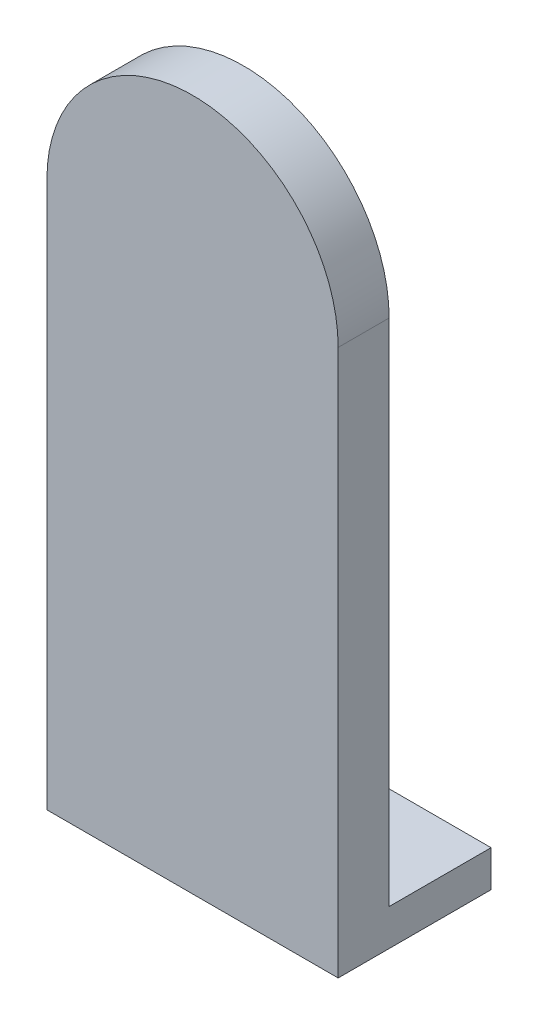
ISO-10303-21;
HEADER;
FILE_DESCRIPTION(('STEP AP214'),'2;1');
FILE_NAME('part.step','',(''),(''),'','','');
FILE_SCHEMA(('AUTOMOTIVE_DESIGN { 1 0 10303 214 1 1 1 1 }'));
ENDSEC;
DATA;
#1=APPLICATION_CONTEXT('core data for automotive mechanical design processes');
#2=APPLICATION_PROTOCOL_DEFINITION('international standard','automotive_design',2000,#1);
#3=PRODUCT_CONTEXT('',#1,'mechanical');
#4=PRODUCT('Part','Part','',(#3));
#5=PRODUCT_RELATED_PRODUCT_CATEGORY('part','',(#4));
#6=PRODUCT_DEFINITION_FORMATION('','',#4);
#7=PRODUCT_DEFINITION_CONTEXT('part definition',#1,'design');
#8=PRODUCT_DEFINITION('design','',#6,#7);
#9=PRODUCT_DEFINITION_SHAPE('','',#8);
#10=(LENGTH_UNIT() NAMED_UNIT(*) SI_UNIT(.MILLI.,.METRE.));
#11=(NAMED_UNIT(*) PLANE_ANGLE_UNIT() SI_UNIT($,.RADIAN.));
#12=(NAMED_UNIT(*) SI_UNIT($,.STERADIAN.) SOLID_ANGLE_UNIT());
#13=UNCERTAINTY_MEASURE_WITH_UNIT(LENGTH_MEASURE(1.E-05),#10,'distance_accuracy_value','');
#14=(GEOMETRIC_REPRESENTATION_CONTEXT(3) GLOBAL_UNCERTAINTY_ASSIGNED_CONTEXT((#13)) GLOBAL_UNIT_ASSIGNED_CONTEXT((#10,
#11,#12)) REPRESENTATION_CONTEXT('',''));
#15=CARTESIAN_POINT('',(0.,0.,0.));
#16=DIRECTION('',(0.,0.,1.));
#17=DIRECTION('',(1.,0.,0.));
#18=AXIS2_PLACEMENT_3D('',#15,#16,#17);
#19=CARTESIAN_POINT('',(0.,0.,0.));
#20=DIRECTION('',(0.,0.,1.));
#21=DIRECTION('',(1.,0.,0.));
#22=AXIS2_PLACEMENT_3D('',#19,#20,#21);
#23=PLANE('',#22);
#24=CARTESIAN_POINT('',(0.,0.,0.));
#25=DIRECTION('',(0.,0.,1.));
#26=DIRECTION('',(1.,0.,0.));
#27=AXIS2_PLACEMENT_3D('',#24,#25,#26);
#28=CIRCLE('',#27,5.);
#29=CARTESIAN_POINT('',(5.,0.,0.));
#30=VERTEX_POINT('',#29);
#31=EDGE_CURVE('E11',#30,#30,#28,.F.);
#32=ORIENTED_EDGE('',*,*,#31,.F.);
#33=EDGE_LOOP('',(#32));
#34=FACE_BOUND('',#33,.T.);
#35=DIRECTION('',(1.,0.,0.));
#36=VECTOR('',#35,1.);
#37=CARTESIAN_POINT('',(20.,-70.,0.));
#38=LINE('',#37,#36);
#39=CARTESIAN_POINT('',(-20.,-70.,0.));
#40=VERTEX_POINT('',#39);
#41=CARTESIAN_POINT('',(20.,-70.,0.));
#42=VERTEX_POINT('',#41);
#43=EDGE_CURVE('E52',#40,#42,#38,.T.);
#44=ORIENTED_EDGE('',*,*,#43,.F.);
#45=DIRECTION('',(0.,-1.,0.));
#46=VECTOR('',#45,1.);
#47=CARTESIAN_POINT('',(-20.,0.,0.));
#48=LINE('',#47,#46);
#49=CARTESIAN_POINT('',(-20.,0.,0.));
#50=VERTEX_POINT('',#49);
#51=EDGE_CURVE('E145',#50,#40,#48,.T.);
#52=ORIENTED_EDGE('',*,*,#51,.F.);
#53=CARTESIAN_POINT('',(0.,0.,0.));
#54=DIRECTION('',(0.,0.,1.));
#55=DIRECTION('',(1.,0.,0.));
#56=AXIS2_PLACEMENT_3D('',#53,#54,#55);
#57=CIRCLE('',#56,20.);
#58=CARTESIAN_POINT('',(20.,0.,0.));
#59=VERTEX_POINT('',#58);
#60=EDGE_CURVE('E136',#59,#50,#57,.T.);
#61=ORIENTED_EDGE('',*,*,#60,.F.);
#62=DIRECTION('',(0.,1.,0.));
#63=VECTOR('',#62,1.);
#64=CARTESIAN_POINT('',(20.,0.,0.));
#65=LINE('',#64,#63);
#66=EDGE_CURVE('E74',#42,#59,#65,.T.);
#67=ORIENTED_EDGE('',*,*,#66,.F.);
#68=EDGE_LOOP('',(#44,#52,#61,#67));
#69=FACE_BOUND('',#68,.T.);
#70=ADVANCED_FACE('F37',(#34,#69),#23,.F.);
#71=CARTESIAN_POINT('',(0.,0.,7.));
#72=DIRECTION('',(0.,0.,-1.));
#73=DIRECTION('',(-1.,0.,0.));
#74=AXIS2_PLACEMENT_3D('',#71,#72,#73);
#75=CYLINDRICAL_SURFACE('',#74,20.);
#76=ORIENTED_EDGE('',*,*,#60,.T.);
#77=DIRECTION('',(0.,0.,-1.));
#78=VECTOR('',#77,1.);
#79=CARTESIAN_POINT('',(-20.,0.,7.));
#80=LINE('',#79,#78);
#81=CARTESIAN_POINT('',(-20.,0.,7.));
#82=VERTEX_POINT('',#81);
#83=EDGE_CURVE('E45',#82,#50,#80,.T.);
#84=ORIENTED_EDGE('',*,*,#83,.F.);
#85=CARTESIAN_POINT('',(0.,0.,7.));
#86=DIRECTION('',(0.,0.,1.));
#87=DIRECTION('',(1.,0.,0.));
#88=AXIS2_PLACEMENT_3D('',#85,#86,#87);
#89=CIRCLE('',#88,20.);
#90=CARTESIAN_POINT('',(20.,0.,7.));
#91=VERTEX_POINT('',#90);
#92=EDGE_CURVE('E137',#91,#82,#89,.T.);
#93=ORIENTED_EDGE('',*,*,#92,.F.);
#94=DIRECTION('',(0.,0.,-1.));
#95=VECTOR('',#94,1.);
#96=CARTESIAN_POINT('',(20.,0.,7.));
#97=LINE('',#96,#95);
#98=EDGE_CURVE('E106',#91,#59,#97,.T.);
#99=ORIENTED_EDGE('',*,*,#98,.T.);
#100=EDGE_LOOP('',(#76,#84,#93,#99));
#101=FACE_BOUND('',#100,.T.);
#102=ADVANCED_FACE('F39',(#101),#75,.T.);
#103=CARTESIAN_POINT('',(-20.,0.,7.));
#104=DIRECTION('',(1.,0.,0.));
#105=DIRECTION('',(0.,1.,0.));
#106=AXIS2_PLACEMENT_3D('',#103,#104,#105);
#107=PLANE('',#106);
#108=ORIENTED_EDGE('',*,*,#51,.T.);
#109=DIRECTION('',(0.,0.,1.));
#110=VECTOR('',#109,1.);
#111=CARTESIAN_POINT('',(-20.,-70.,-14.));
#112=LINE('',#111,#110);
#113=CARTESIAN_POINT('',(-20.,-70.,-14.));
#114=VERTEX_POINT('',#113);
#115=EDGE_CURVE('E130',#114,#40,#112,.T.);
#116=ORIENTED_EDGE('',*,*,#115,.F.);
#117=DIRECTION('',(0.,1.,0.));
#118=VECTOR('',#117,1.);
#119=CARTESIAN_POINT('',(-20.,-70.,-14.));
#120=LINE('',#119,#118);
#121=CARTESIAN_POINT('',(-20.,-75.,-14.));
#122=VERTEX_POINT('',#121);
#123=EDGE_CURVE('E113',#122,#114,#120,.T.);
#124=ORIENTED_EDGE('',*,*,#123,.F.);
#125=DIRECTION('',(0.,0.,-1.));
#126=VECTOR('',#125,1.);
#127=CARTESIAN_POINT('',(-20.,-75.,7.));
#128=LINE('',#127,#126);
#129=CARTESIAN_POINT('',(-20.,-75.,7.));
#130=VERTEX_POINT('',#129);
#131=EDGE_CURVE('E105',#130,#122,#128,.T.);
#132=ORIENTED_EDGE('',*,*,#131,.F.);
#133=DIRECTION('',(0.,-1.,0.));
#134=VECTOR('',#133,1.);
#135=CARTESIAN_POINT('',(-20.,0.,7.));
#136=LINE('',#135,#134);
#137=EDGE_CURVE('E82',#82,#130,#136,.T.);
#138=ORIENTED_EDGE('',*,*,#137,.F.);
#139=ORIENTED_EDGE('',*,*,#83,.T.);
#140=EDGE_LOOP('',(#108,#116,#124,#132,#138,#139));
#141=FACE_BOUND('',#140,.T.);
#142=ADVANCED_FACE('F151',(#141),#107,.F.);
#143=CARTESIAN_POINT('',(-20.,-75.,7.));
#144=DIRECTION('',(0.,1.,0.));
#145=DIRECTION('',(0.,0.,1.));
#146=AXIS2_PLACEMENT_3D('',#143,#144,#145);
#147=PLANE('',#146);
#148=CARTESIAN_POINT('',(-10.,-75.,-7.));
#149=DIRECTION('',(0.,1.,0.));
#150=DIRECTION('',(0.,0.,1.));
#151=AXIS2_PLACEMENT_3D('',#148,#149,#150);
#152=CIRCLE('',#151,1.5);
#153=CARTESIAN_POINT('',(-10.,-75.,-5.5));
#154=VERTEX_POINT('',#153);
#155=EDGE_CURVE('E282',#154,#154,#152,.T.);
#156=ORIENTED_EDGE('',*,*,#155,.T.);
#157=EDGE_LOOP('',(#156));
#158=FACE_BOUND('',#157,.T.);
#159=CARTESIAN_POINT('',(10.,-75.,-7.));
#160=DIRECTION('',(0.,1.,0.));
#161=DIRECTION('',(0.,0.,1.));
#162=AXIS2_PLACEMENT_3D('',#159,#160,#161);
#163=CIRCLE('',#162,1.5);
#164=CARTESIAN_POINT('',(10.,-75.,-5.5));
#165=VERTEX_POINT('',#164);
#166=EDGE_CURVE('E120',#165,#165,#163,.T.);
#167=ORIENTED_EDGE('',*,*,#166,.T.);
#168=EDGE_LOOP('',(#167));
#169=FACE_BOUND('',#168,.T.);
#170=ORIENTED_EDGE('',*,*,#131,.T.);
#171=DIRECTION('',(-1.,0.,0.));
#172=VECTOR('',#171,1.);
#173=CARTESIAN_POINT('',(20.,-75.,-14.));
#174=LINE('',#173,#172);
#175=CARTESIAN_POINT('',(20.,-75.,-14.));
#176=VERTEX_POINT('',#175);
#177=EDGE_CURVE('E109',#176,#122,#174,.T.);
#178=ORIENTED_EDGE('',*,*,#177,.F.);
#179=DIRECTION('',(0.,0.,-1.));
#180=VECTOR('',#179,1.);
#181=CARTESIAN_POINT('',(20.,-75.,7.));
#182=LINE('',#181,#180);
#183=CARTESIAN_POINT('',(20.,-75.,7.));
#184=VERTEX_POINT('',#183);
#185=EDGE_CURVE('E98',#184,#176,#182,.T.);
#186=ORIENTED_EDGE('',*,*,#185,.F.);
#187=DIRECTION('',(1.,0.,0.));
#188=VECTOR('',#187,1.);
#189=CARTESIAN_POINT('',(-20.,-75.,7.));
#190=LINE('',#189,#188);
#191=EDGE_CURVE('E140',#130,#184,#190,.T.);
#192=ORIENTED_EDGE('',*,*,#191,.F.);
#193=EDGE_LOOP('',(#170,#178,#186,#192));
#194=FACE_BOUND('',#193,.T.);
#195=ADVANCED_FACE('F110',(#158,#169,#194),#147,.F.);
#196=CARTESIAN_POINT('',(20.,0.,7.));
#197=DIRECTION('',(-1.,0.,0.));
#198=DIRECTION('',(0.,-1.,0.));
#199=AXIS2_PLACEMENT_3D('',#196,#197,#198);
#200=PLANE('',#199);
#201=ORIENTED_EDGE('',*,*,#185,.T.);
#202=DIRECTION('',(0.,-1.,0.));
#203=VECTOR('',#202,1.);
#204=CARTESIAN_POINT('',(20.,-70.,-14.));
#205=LINE('',#204,#203);
#206=CARTESIAN_POINT('',(20.,-70.,-14.));
#207=VERTEX_POINT('',#206);
#208=EDGE_CURVE('E102',#207,#176,#205,.T.);
#209=ORIENTED_EDGE('',*,*,#208,.F.);
#210=DIRECTION('',(0.,0.,1.));
#211=VECTOR('',#210,1.);
#212=CARTESIAN_POINT('',(20.,-70.,-14.));
#213=LINE('',#212,#211);
#214=EDGE_CURVE('E127',#207,#42,#213,.T.);
#215=ORIENTED_EDGE('',*,*,#214,.T.);
#216=ORIENTED_EDGE('',*,*,#66,.T.);
#217=ORIENTED_EDGE('',*,*,#98,.F.);
#218=DIRECTION('',(0.,1.,0.));
#219=VECTOR('',#218,1.);
#220=CARTESIAN_POINT('',(20.,0.,7.));
#221=LINE('',#220,#219);
#222=EDGE_CURVE('E61',#184,#91,#221,.T.);
#223=ORIENTED_EDGE('',*,*,#222,.F.);
#224=EDGE_LOOP('',(#201,#209,#215,#216,#217,#223));
#225=FACE_BOUND('',#224,.T.);
#226=ADVANCED_FACE('F100',(#225),#200,.F.);
#227=CARTESIAN_POINT('',(0.,0.,7.));
#228=DIRECTION('',(0.,0.,1.));
#229=DIRECTION('',(1.,0.,0.));
#230=AXIS2_PLACEMENT_3D('',#227,#228,#229);
#231=PLANE('',#230);
#232=ORIENTED_EDGE('',*,*,#92,.T.);
#233=ORIENTED_EDGE('',*,*,#137,.T.);
#234=ORIENTED_EDGE('',*,*,#191,.T.);
#235=ORIENTED_EDGE('',*,*,#222,.T.);
#236=EDGE_LOOP('',(#232,#233,#234,#235));
#237=FACE_BOUND('',#236,.T.);
#238=ADVANCED_FACE('F158',(#237),#231,.T.);
#239=CARTESIAN_POINT('',(0.,0.,-4.));
#240=DIRECTION('',(0.,0.,1.));
#241=DIRECTION('',(1.,0.,0.));
#242=AXIS2_PLACEMENT_3D('',#239,#240,#241);
#243=CYLINDRICAL_SURFACE('',#242,5.);
#244=CARTESIAN_POINT('',(0.,0.,-4.));
#245=DIRECTION('',(0.,0.,-1.));
#246=DIRECTION('',(-1.,0.,0.));
#247=AXIS2_PLACEMENT_3D('',#244,#245,#246);
#248=CIRCLE('',#247,5.);
#249=CARTESIAN_POINT('',(-5.,0.,-4.));
#250=VERTEX_POINT('',#249);
#251=EDGE_CURVE('E133',#250,#250,#248,.T.);
#252=ORIENTED_EDGE('',*,*,#251,.F.);
#253=EDGE_LOOP('',(#252));
#254=FACE_BOUND('',#253,.T.);
#255=ORIENTED_EDGE('',*,*,#31,.T.);
#256=EDGE_LOOP('',(#255));
#257=FACE_BOUND('',#256,.T.);
#258=ADVANCED_FACE('F160',(#254,#257),#243,.T.);
#259=CARTESIAN_POINT('',(0.,0.,-4.));
#260=DIRECTION('',(0.,0.,-1.));
#261=DIRECTION('',(-1.,0.,0.));
#262=AXIS2_PLACEMENT_3D('',#259,#260,#261);
#263=PLANE('',#262);
#264=ORIENTED_EDGE('',*,*,#251,.T.);
#265=EDGE_LOOP('',(#264));
#266=FACE_BOUND('',#265,.T.);
#267=ADVANCED_FACE('F166',(#266),#263,.T.);
#268=CARTESIAN_POINT('',(20.,-70.,-14.));
#269=DIRECTION('',(0.,-1.,0.));
#270=DIRECTION('',(0.,0.,-1.));
#271=AXIS2_PLACEMENT_3D('',#268,#269,#270);
#272=PLANE('',#271);
#273=CARTESIAN_POINT('',(-10.,-70.,-7.));
#274=DIRECTION('',(0.,1.,0.));
#275=DIRECTION('',(0.,0.,1.));
#276=AXIS2_PLACEMENT_3D('',#273,#274,#275);
#277=CIRCLE('',#276,1.5);
#278=CARTESIAN_POINT('',(-10.,-70.,-5.5));
#279=VERTEX_POINT('',#278);
#280=EDGE_CURVE('E278',#279,#279,#277,.T.);
#281=ORIENTED_EDGE('',*,*,#280,.F.);
#282=EDGE_LOOP('',(#281));
#283=FACE_BOUND('',#282,.T.);
#284=CARTESIAN_POINT('',(10.,-70.,-7.));
#285=DIRECTION('',(0.,1.,0.));
#286=DIRECTION('',(0.,0.,1.));
#287=AXIS2_PLACEMENT_3D('',#284,#285,#286);
#288=CIRCLE('',#287,1.5);
#289=CARTESIAN_POINT('',(10.,-70.,-5.5));
#290=VERTEX_POINT('',#289);
#291=EDGE_CURVE('E123',#290,#290,#288,.T.);
#292=ORIENTED_EDGE('',*,*,#291,.F.);
#293=EDGE_LOOP('',(#292));
#294=FACE_BOUND('',#293,.T.);
#295=ORIENTED_EDGE('',*,*,#43,.T.);
#296=ORIENTED_EDGE('',*,*,#214,.F.);
#297=DIRECTION('',(1.,0.,0.));
#298=VECTOR('',#297,1.);
#299=CARTESIAN_POINT('',(20.,-70.,-14.));
#300=LINE('',#299,#298);
#301=EDGE_CURVE('E117',#114,#207,#300,.T.);
#302=ORIENTED_EDGE('',*,*,#301,.F.);
#303=ORIENTED_EDGE('',*,*,#115,.T.);
#304=EDGE_LOOP('',(#295,#296,#302,#303));
#305=FACE_BOUND('',#304,.T.);
#306=ADVANCED_FACE('F157',(#283,#294,#305),#272,.F.);
#307=CARTESIAN_POINT('',(0.,0.,-14.));
#308=DIRECTION('',(0.,0.,-1.));
#309=DIRECTION('',(-1.,0.,0.));
#310=AXIS2_PLACEMENT_3D('',#307,#308,#309);
#311=PLANE('',#310);
#312=ORIENTED_EDGE('',*,*,#208,.T.);
#313=ORIENTED_EDGE('',*,*,#177,.T.);
#314=ORIENTED_EDGE('',*,*,#123,.T.);
#315=ORIENTED_EDGE('',*,*,#301,.T.);
#316=EDGE_LOOP('',(#312,#313,#314,#315));
#317=FACE_BOUND('',#316,.T.);
#318=ADVANCED_FACE('F115',(#317),#311,.T.);
#319=CARTESIAN_POINT('',(10.,-75.,-7.));
#320=DIRECTION('',(0.,1.,0.));
#321=DIRECTION('',(0.,0.,1.));
#322=AXIS2_PLACEMENT_3D('',#319,#320,#321);
#323=CYLINDRICAL_SURFACE('',#322,1.5);
#324=ORIENTED_EDGE('',*,*,#166,.F.);
#325=EDGE_LOOP('',(#324));
#326=FACE_BOUND('',#325,.T.);
#327=ORIENTED_EDGE('',*,*,#291,.T.);
#328=EDGE_LOOP('',(#327));
#329=FACE_BOUND('',#328,.T.);
#330=ADVANCED_FACE('F204',(#326,#329),#323,.F.);
#331=CARTESIAN_POINT('',(-10.,-75.,-7.));
#332=DIRECTION('',(0.,1.,0.));
#333=DIRECTION('',(0.,0.,1.));
#334=AXIS2_PLACEMENT_3D('',#331,#332,#333);
#335=CYLINDRICAL_SURFACE('',#334,1.5);
#336=ORIENTED_EDGE('',*,*,#155,.F.);
#337=EDGE_LOOP('',(#336));
#338=FACE_BOUND('',#337,.T.);
#339=ORIENTED_EDGE('',*,*,#280,.T.);
#340=EDGE_LOOP('',(#339));
#341=FACE_BOUND('',#340,.T.);
#342=ADVANCED_FACE('F217',(#338,#341),#335,.F.);
#343=CLOSED_SHELL('',(#70,#102,#142,#195,#226,#238,#258,#267,#306,#318,#330,#342));
#344=MANIFOLD_SOLID_BREP('B2',#343);
#345=ADVANCED_BREP_SHAPE_REPRESENTATION('',(#18,#344),#14);
#346=SHAPE_DEFINITION_REPRESENTATION(#9,#345);
ENDSEC;
END-ISO-10303-21;
